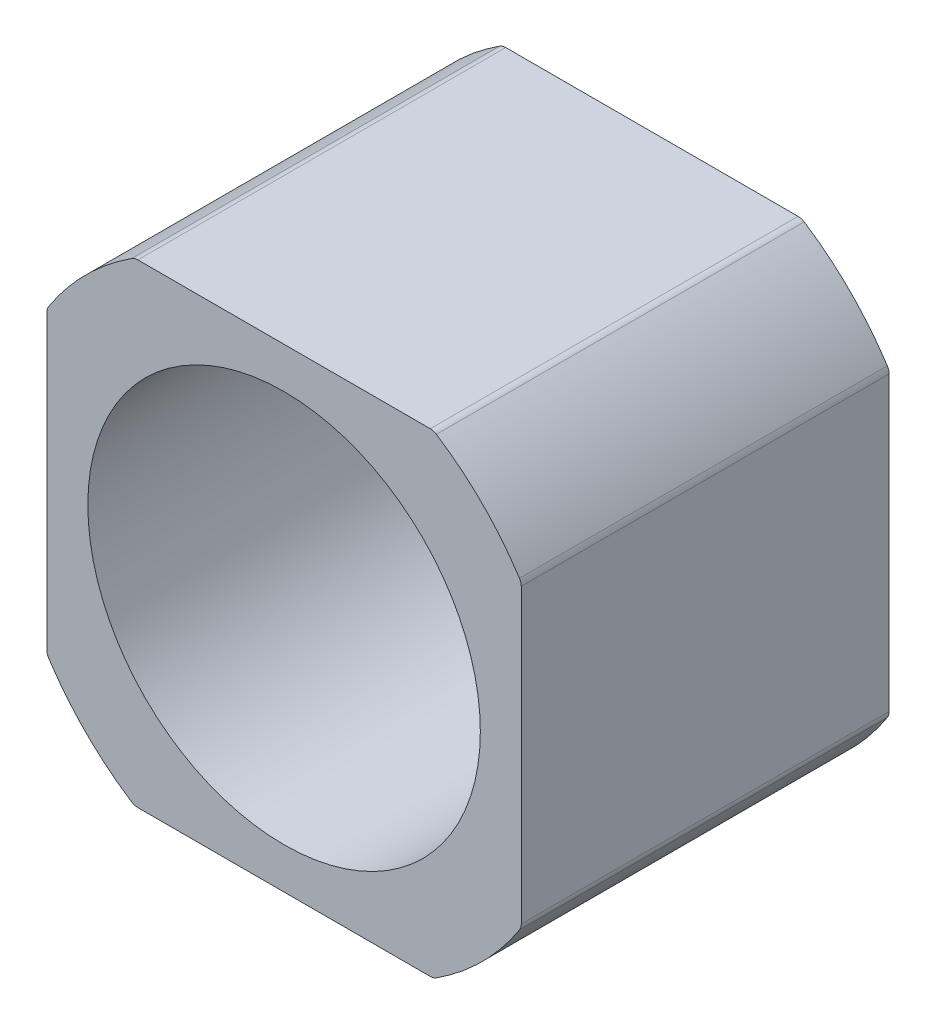
ISO-10303-21;
HEADER;
FILE_DESCRIPTION(('STEP AP214'),'2;1');
FILE_NAME('part.step','',(''),(''),'','','');
FILE_SCHEMA(('AUTOMOTIVE_DESIGN { 1 0 10303 214 1 1 1 1 }'));
ENDSEC;
DATA;
#1=APPLICATION_CONTEXT('core data for automotive mechanical design processes');
#2=APPLICATION_PROTOCOL_DEFINITION('international standard','automotive_design',2000,#1);
#3=PRODUCT_CONTEXT('',#1,'mechanical');
#4=PRODUCT('Part','Part','',(#3));
#5=PRODUCT_RELATED_PRODUCT_CATEGORY('part','',(#4));
#6=PRODUCT_DEFINITION_FORMATION('','',#4);
#7=PRODUCT_DEFINITION_CONTEXT('part definition',#1,'design');
#8=PRODUCT_DEFINITION('design','',#6,#7);
#9=PRODUCT_DEFINITION_SHAPE('','',#8);
#10=(LENGTH_UNIT() NAMED_UNIT(*) SI_UNIT(.MILLI.,.METRE.));
#11=(NAMED_UNIT(*) PLANE_ANGLE_UNIT() SI_UNIT($,.RADIAN.));
#12=(NAMED_UNIT(*) SI_UNIT($,.STERADIAN.) SOLID_ANGLE_UNIT());
#13=UNCERTAINTY_MEASURE_WITH_UNIT(LENGTH_MEASURE(1.E-05),#10,'distance_accuracy_value','');
#14=(GEOMETRIC_REPRESENTATION_CONTEXT(3) GLOBAL_UNCERTAINTY_ASSIGNED_CONTEXT((#13)) GLOBAL_UNIT_ASSIGNED_CONTEXT((#10,
#11,#12)) REPRESENTATION_CONTEXT('',''));
#15=CARTESIAN_POINT('',(0.,0.,0.));
#16=DIRECTION('',(0.,0.,1.));
#17=DIRECTION('',(1.,0.,0.));
#18=AXIS2_PLACEMENT_3D('',#15,#16,#17);
#19=CARTESIAN_POINT('',(21.15,21.15,32.8));
#20=DIRECTION('',(-1.,0.,0.));
#21=DIRECTION('',(0.,-1.,0.));
#22=AXIS2_PLACEMENT_3D('',#19,#20,#21);
#23=PLANE('',#22);
#24=DIRECTION('',(0.,1.,0.));
#25=VECTOR('',#24,1.);
#26=CARTESIAN_POINT('',(21.15,21.15,32.8));
#27=LINE('',#26,#25);
#28=CARTESIAN_POINT('',(21.15,-13.0375419462412,32.8));
#29=VERTEX_POINT('',#28);
#30=CARTESIAN_POINT('',(21.15,13.0375419462412,32.8));
#31=VERTEX_POINT('',#30);
#32=EDGE_CURVE('E207',#29,#31,#27,.T.);
#33=ORIENTED_EDGE('',*,*,#32,.F.);
#34=DIRECTION('',(0.,0.,-1.));
#35=VECTOR('',#34,1.);
#36=CARTESIAN_POINT('',(21.15,-13.0375419462412,0.));
#37=LINE('',#36,#35);
#38=CARTESIAN_POINT('',(21.15,-13.0375419462412,0.));
#39=VERTEX_POINT('',#38);
#40=EDGE_CURVE('E273',#29,#39,#37,.T.);
#41=ORIENTED_EDGE('',*,*,#40,.T.);
#42=DIRECTION('',(0.,1.,0.));
#43=VECTOR('',#42,1.);
#44=CARTESIAN_POINT('',(21.15,21.15,0.));
#45=LINE('',#44,#43);
#46=CARTESIAN_POINT('',(21.15,13.0375419462412,0.));
#47=VERTEX_POINT('',#46);
#48=EDGE_CURVE('E197',#39,#47,#45,.T.);
#49=ORIENTED_EDGE('',*,*,#48,.T.);
#50=DIRECTION('',(0.,0.,-1.));
#51=VECTOR('',#50,1.);
#52=CARTESIAN_POINT('',(21.15,13.0375419462412,32.8));
#53=LINE('',#52,#51);
#54=EDGE_CURVE('E271',#47,#31,#53,.F.);
#55=ORIENTED_EDGE('',*,*,#54,.T.);
#56=EDGE_LOOP('',(#33,#41,#49,#55));
#57=FACE_BOUND('',#56,.T.);
#58=ADVANCED_FACE('F34',(#57),#23,.F.);
#59=CARTESIAN_POINT('',(-21.15,21.15,32.8));
#60=DIRECTION('',(0.,-1.,0.));
#61=DIRECTION('',(1.,0.,0.));
#62=AXIS2_PLACEMENT_3D('',#59,#60,#61);
#63=PLANE('',#62);
#64=DIRECTION('',(-1.,0.,0.));
#65=VECTOR('',#64,1.);
#66=CARTESIAN_POINT('',(-21.15,21.15,0.));
#67=LINE('',#66,#65);
#68=CARTESIAN_POINT('',(13.0375419462413,21.15,0.));
#69=VERTEX_POINT('',#68);
#70=CARTESIAN_POINT('',(-13.0375419462413,21.15,0.));
#71=VERTEX_POINT('',#70);
#72=EDGE_CURVE('E200',#69,#71,#67,.T.);
#73=ORIENTED_EDGE('',*,*,#72,.T.);
#74=DIRECTION('',(0.,0.,-1.));
#75=VECTOR('',#74,1.);
#76=CARTESIAN_POINT('',(-13.0375419462413,21.15,32.8));
#77=LINE('',#76,#75);
#78=CARTESIAN_POINT('',(-13.0375419462413,21.15,32.8));
#79=VERTEX_POINT('',#78);
#80=EDGE_CURVE('E155',#71,#79,#77,.F.);
#81=ORIENTED_EDGE('',*,*,#80,.T.);
#82=DIRECTION('',(-1.,0.,0.));
#83=VECTOR('',#82,1.);
#84=CARTESIAN_POINT('',(-21.15,21.15,32.8));
#85=LINE('',#84,#83);
#86=CARTESIAN_POINT('',(13.0375419462413,21.15,32.8));
#87=VERTEX_POINT('',#86);
#88=EDGE_CURVE('E193',#87,#79,#85,.T.);
#89=ORIENTED_EDGE('',*,*,#88,.F.);
#90=DIRECTION('',(0.,0.,-1.));
#91=VECTOR('',#90,1.);
#92=CARTESIAN_POINT('',(13.0375419462413,21.15,0.));
#93=LINE('',#92,#91);
#94=EDGE_CURVE('E160',#87,#69,#93,.T.);
#95=ORIENTED_EDGE('',*,*,#94,.T.);
#96=EDGE_LOOP('',(#73,#81,#89,#95));
#97=FACE_BOUND('',#96,.T.);
#98=ADVANCED_FACE('F320',(#97),#63,.F.);
#99=CARTESIAN_POINT('',(-21.15,21.15,32.8));
#100=DIRECTION('',(1.,0.,0.));
#101=DIRECTION('',(0.,0.,-1.));
#102=AXIS2_PLACEMENT_3D('',#99,#100,#101);
#103=PLANE('',#102);
#104=DIRECTION('',(0.,-1.,0.));
#105=VECTOR('',#104,1.);
#106=CARTESIAN_POINT('',(-21.15,21.15,32.8));
#107=LINE('',#106,#105);
#108=CARTESIAN_POINT('',(-21.15,13.0375419462413,32.8));
#109=VERTEX_POINT('',#108);
#110=CARTESIAN_POINT('',(-21.15,-13.0375419462413,32.8));
#111=VERTEX_POINT('',#110);
#112=EDGE_CURVE('E189',#109,#111,#107,.T.);
#113=ORIENTED_EDGE('',*,*,#112,.F.);
#114=DIRECTION('',(0.,0.,-1.));
#115=VECTOR('',#114,1.);
#116=CARTESIAN_POINT('',(-21.15,13.0375419462413,0.));
#117=LINE('',#116,#115);
#118=CARTESIAN_POINT('',(-21.15,13.0375419462413,0.));
#119=VERTEX_POINT('',#118);
#120=EDGE_CURVE('E250',#109,#119,#117,.T.);
#121=ORIENTED_EDGE('',*,*,#120,.T.);
#122=DIRECTION('',(0.,-1.,0.));
#123=VECTOR('',#122,1.);
#124=CARTESIAN_POINT('',(-21.15,21.15,0.));
#125=LINE('',#124,#123);
#126=CARTESIAN_POINT('',(-21.15,-13.0375419462413,0.));
#127=VERTEX_POINT('',#126);
#128=EDGE_CURVE('E203',#119,#127,#125,.T.);
#129=ORIENTED_EDGE('',*,*,#128,.T.);
#130=DIRECTION('',(0.,0.,-1.));
#131=VECTOR('',#130,1.);
#132=CARTESIAN_POINT('',(-21.15,-13.0375419462413,32.8));
#133=LINE('',#132,#131);
#134=EDGE_CURVE('E247',#127,#111,#133,.F.);
#135=ORIENTED_EDGE('',*,*,#134,.T.);
#136=EDGE_LOOP('',(#113,#121,#129,#135));
#137=FACE_BOUND('',#136,.T.);
#138=ADVANCED_FACE('F322',(#137),#103,.F.);
#139=CARTESIAN_POINT('',(-21.15,-21.15,32.8));
#140=DIRECTION('',(0.,1.,0.));
#141=DIRECTION('',(0.,0.,1.));
#142=AXIS2_PLACEMENT_3D('',#139,#140,#141);
#143=PLANE('',#142);
#144=DIRECTION('',(1.,0.,0.));
#145=VECTOR('',#144,1.);
#146=CARTESIAN_POINT('',(-21.15,-21.15,32.8));
#147=LINE('',#146,#145);
#148=CARTESIAN_POINT('',(-13.0375419462412,-21.15,32.8));
#149=VERTEX_POINT('',#148);
#150=CARTESIAN_POINT('',(13.0375419462412,-21.15,32.8));
#151=VERTEX_POINT('',#150);
#152=EDGE_CURVE('E185',#149,#151,#147,.T.);
#153=ORIENTED_EDGE('',*,*,#152,.F.);
#154=DIRECTION('',(0.,0.,-1.));
#155=VECTOR('',#154,1.);
#156=CARTESIAN_POINT('',(-13.0375419462412,-21.15,0.));
#157=LINE('',#156,#155);
#158=CARTESIAN_POINT('',(-13.0375419462412,-21.15,0.));
#159=VERTEX_POINT('',#158);
#160=EDGE_CURVE('E265',#149,#159,#157,.T.);
#161=ORIENTED_EDGE('',*,*,#160,.T.);
#162=DIRECTION('',(1.,0.,0.));
#163=VECTOR('',#162,1.);
#164=CARTESIAN_POINT('',(-21.15,-21.15,0.));
#165=LINE('',#164,#163);
#166=CARTESIAN_POINT('',(13.0375419462412,-21.15,0.));
#167=VERTEX_POINT('',#166);
#168=EDGE_CURVE('E205',#159,#167,#165,.T.);
#169=ORIENTED_EDGE('',*,*,#168,.T.);
#170=DIRECTION('',(0.,0.,-1.));
#171=VECTOR('',#170,1.);
#172=CARTESIAN_POINT('',(13.0375419462412,-21.15,32.8));
#173=LINE('',#172,#171);
#174=EDGE_CURVE('E263',#167,#151,#173,.F.);
#175=ORIENTED_EDGE('',*,*,#174,.T.);
#176=EDGE_LOOP('',(#153,#161,#169,#175));
#177=FACE_BOUND('',#176,.T.);
#178=ADVANCED_FACE('F239',(#177),#143,.F.);
#179=CARTESIAN_POINT('',(0.,0.,32.8));
#180=DIRECTION('',(0.,0.,1.));
#181=DIRECTION('',(1.,0.,0.));
#182=AXIS2_PLACEMENT_3D('',#179,#180,#181);
#183=PLANE('',#182);
#184=CARTESIAN_POINT('',(0.,0.,32.8));
#185=DIRECTION('',(0.,0.,1.));
#186=DIRECTION('',(1.,0.,0.));
#187=AXIS2_PLACEMENT_3D('',#184,#185,#186);
#188=CIRCLE('',#187,17.5);
#189=CARTESIAN_POINT('',(17.5,0.,32.8));
#190=VERTEX_POINT('',#189);
#191=EDGE_CURVE('E224',#190,#190,#188,.T.);
#192=ORIENTED_EDGE('',*,*,#191,.F.);
#193=EDGE_LOOP('',(#192));
#194=FACE_BOUND('',#193,.T.);
#195=ORIENTED_EDGE('',*,*,#88,.T.);
#196=CARTESIAN_POINT('',(-13.0375419462413,20.15,32.8));
#197=DIRECTION('',(0.,0.,1.));
#198=DIRECTION('',(1.,0.,0.));
#199=AXIS2_PLACEMENT_3D('',#196,#197,#198);
#200=CIRCLE('',#199,1.);
#201=CARTESIAN_POINT('',(-13.580772860668,20.9895833333333,32.8));
#202=VERTEX_POINT('',#201);
#203=EDGE_CURVE('E242',#79,#202,#200,.T.);
#204=ORIENTED_EDGE('',*,*,#203,.T.);
#205=CARTESIAN_POINT('',(0.,0.,32.8));
#206=DIRECTION('',(0.,0.,1.));
#207=DIRECTION('',(1.,0.,0.));
#208=AXIS2_PLACEMENT_3D('',#205,#206,#207);
#209=CIRCLE('',#208,25.);
#210=CARTESIAN_POINT('',(-20.9895833333333,13.580772860668,32.8));
#211=VERTEX_POINT('',#210);
#212=EDGE_CURVE('E171',#202,#211,#209,.T.);
#213=ORIENTED_EDGE('',*,*,#212,.T.);
#214=CARTESIAN_POINT('',(-20.15,13.0375419462413,32.8));
#215=DIRECTION('',(0.,0.,1.));
#216=DIRECTION('',(1.,0.,0.));
#217=AXIS2_PLACEMENT_3D('',#214,#215,#216);
#218=CIRCLE('',#217,1.);
#219=EDGE_CURVE('E248',#211,#109,#218,.T.);
#220=ORIENTED_EDGE('',*,*,#219,.T.);
#221=ORIENTED_EDGE('',*,*,#112,.T.);
#222=CARTESIAN_POINT('',(-20.15,-13.0375419462413,32.8));
#223=DIRECTION('',(0.,0.,1.));
#224=DIRECTION('',(1.,0.,0.));
#225=AXIS2_PLACEMENT_3D('',#222,#223,#224);
#226=CIRCLE('',#225,1.);
#227=CARTESIAN_POINT('',(-20.9895833333333,-13.580772860668,32.8));
#228=VERTEX_POINT('',#227);
#229=EDGE_CURVE('E252',#111,#228,#226,.T.);
#230=ORIENTED_EDGE('',*,*,#229,.T.);
#231=CARTESIAN_POINT('',(-13.580772860668,-20.9895833333333,32.8));
#232=VERTEX_POINT('',#231);
#233=EDGE_CURVE('E219',#228,#232,#209,.T.);
#234=ORIENTED_EDGE('',*,*,#233,.T.);
#235=CARTESIAN_POINT('',(-13.0375419462412,-20.15,32.8));
#236=DIRECTION('',(0.,0.,1.));
#237=DIRECTION('',(1.,0.,0.));
#238=AXIS2_PLACEMENT_3D('',#235,#236,#237);
#239=CIRCLE('',#238,1.);
#240=EDGE_CURVE('E286',#232,#149,#239,.T.);
#241=ORIENTED_EDGE('',*,*,#240,.T.);
#242=ORIENTED_EDGE('',*,*,#152,.T.);
#243=CARTESIAN_POINT('',(13.0375419462412,-20.15,32.8));
#244=DIRECTION('',(0.,0.,1.));
#245=DIRECTION('',(1.,0.,0.));
#246=AXIS2_PLACEMENT_3D('',#243,#244,#245);
#247=CIRCLE('',#246,1.);
#248=CARTESIAN_POINT('',(13.580772860668,-20.9895833333333,32.8));
#249=VERTEX_POINT('',#248);
#250=EDGE_CURVE('E57',#151,#249,#247,.T.);
#251=ORIENTED_EDGE('',*,*,#250,.T.);
#252=CARTESIAN_POINT('',(20.9895833333333,-13.580772860668,32.8));
#253=VERTEX_POINT('',#252);
#254=EDGE_CURVE('E217',#249,#253,#209,.T.);
#255=ORIENTED_EDGE('',*,*,#254,.T.);
#256=CARTESIAN_POINT('',(20.15,-13.0375419462412,32.8));
#257=DIRECTION('',(0.,0.,1.));
#258=DIRECTION('',(1.,0.,0.));
#259=AXIS2_PLACEMENT_3D('',#256,#257,#258);
#260=CIRCLE('',#259,1.);
#261=EDGE_CURVE('E49',#253,#29,#260,.T.);
#262=ORIENTED_EDGE('',*,*,#261,.T.);
#263=ORIENTED_EDGE('',*,*,#32,.T.);
#264=CARTESIAN_POINT('',(20.15,13.0375419462412,32.8));
#265=DIRECTION('',(0.,0.,1.));
#266=DIRECTION('',(1.,0.,0.));
#267=AXIS2_PLACEMENT_3D('',#264,#265,#266);
#268=CIRCLE('',#267,1.);
#269=CARTESIAN_POINT('',(20.9895833333333,13.580772860668,32.8));
#270=VERTEX_POINT('',#269);
#271=EDGE_CURVE('E283',#31,#270,#268,.T.);
#272=ORIENTED_EDGE('',*,*,#271,.T.);
#273=CARTESIAN_POINT('',(13.580772860668,20.9895833333333,32.8));
#274=VERTEX_POINT('',#273);
#275=EDGE_CURVE('E223',#270,#274,#209,.T.);
#276=ORIENTED_EDGE('',*,*,#275,.T.);
#277=CARTESIAN_POINT('',(13.0375419462413,20.15,32.8));
#278=DIRECTION('',(0.,0.,1.));
#279=DIRECTION('',(1.,0.,0.));
#280=AXIS2_PLACEMENT_3D('',#277,#278,#279);
#281=CIRCLE('',#280,1.);
#282=EDGE_CURVE('E244',#274,#87,#281,.T.);
#283=ORIENTED_EDGE('',*,*,#282,.T.);
#284=EDGE_LOOP('',(#195,#204,#213,#220,#221,#230,#234,#241,#242,#251,#255,#262,#263,#272,#276,#283));
#285=FACE_BOUND('',#284,.T.);
#286=ADVANCED_FACE('F237',(#194,#285),#183,.T.);
#287=CARTESIAN_POINT('',(0.,0.,0.));
#288=DIRECTION('',(0.,0.,1.));
#289=DIRECTION('',(1.,0.,0.));
#290=AXIS2_PLACEMENT_3D('',#287,#288,#289);
#291=PLANE('',#290);
#292=CARTESIAN_POINT('',(0.,0.,0.));
#293=DIRECTION('',(0.,0.,1.));
#294=DIRECTION('',(1.,0.,0.));
#295=AXIS2_PLACEMENT_3D('',#292,#293,#294);
#296=CIRCLE('',#295,17.5);
#297=CARTESIAN_POINT('',(17.5,0.,0.));
#298=VERTEX_POINT('',#297);
#299=EDGE_CURVE('E220',#298,#298,#296,.T.);
#300=ORIENTED_EDGE('',*,*,#299,.T.);
#301=EDGE_LOOP('',(#300));
#302=FACE_BOUND('',#301,.T.);
#303=CARTESIAN_POINT('',(0.,0.,0.));
#304=DIRECTION('',(0.,0.,1.));
#305=DIRECTION('',(1.,0.,0.));
#306=AXIS2_PLACEMENT_3D('',#303,#304,#305);
#307=CIRCLE('',#306,25.);
#308=CARTESIAN_POINT('',(-13.580772860668,20.9895833333333,0.));
#309=VERTEX_POINT('',#308);
#310=CARTESIAN_POINT('',(-20.9895833333333,13.580772860668,0.));
#311=VERTEX_POINT('',#310);
#312=EDGE_CURVE('E168',#309,#311,#307,.T.);
#313=ORIENTED_EDGE('',*,*,#312,.F.);
#314=CARTESIAN_POINT('',(-13.0375419462413,20.15,0.));
#315=DIRECTION('',(0.,0.,1.));
#316=DIRECTION('',(1.,0.,0.));
#317=AXIS2_PLACEMENT_3D('',#314,#315,#316);
#318=CIRCLE('',#317,1.);
#319=EDGE_CURVE('E150',#309,#71,#318,.F.);
#320=ORIENTED_EDGE('',*,*,#319,.T.);
#321=ORIENTED_EDGE('',*,*,#72,.F.);
#322=CARTESIAN_POINT('',(13.0375419462413,20.15,0.));
#323=DIRECTION('',(0.,0.,1.));
#324=DIRECTION('',(1.,0.,0.));
#325=AXIS2_PLACEMENT_3D('',#322,#323,#324);
#326=CIRCLE('',#325,1.);
#327=CARTESIAN_POINT('',(13.580772860668,20.9895833333333,0.));
#328=VERTEX_POINT('',#327);
#329=EDGE_CURVE('E172',#69,#328,#326,.F.);
#330=ORIENTED_EDGE('',*,*,#329,.T.);
#331=CARTESIAN_POINT('',(0.,0.,0.));
#332=DIRECTION('',(0.,0.,1.));
#333=DIRECTION('',(1.,0.,0.));
#334=AXIS2_PLACEMENT_3D('',#331,#332,#333);
#335=CIRCLE('',#334,25.);
#336=CARTESIAN_POINT('',(20.9895833333333,13.580772860668,0.));
#337=VERTEX_POINT('',#336);
#338=EDGE_CURVE('E201',#337,#328,#335,.T.);
#339=ORIENTED_EDGE('',*,*,#338,.F.);
#340=CARTESIAN_POINT('',(20.15,13.0375419462412,0.));
#341=DIRECTION('',(0.,0.,1.));
#342=DIRECTION('',(1.,0.,0.));
#343=AXIS2_PLACEMENT_3D('',#340,#341,#342);
#344=CIRCLE('',#343,1.);
#345=EDGE_CURVE('E316',#337,#47,#344,.F.);
#346=ORIENTED_EDGE('',*,*,#345,.T.);
#347=ORIENTED_EDGE('',*,*,#48,.F.);
#348=CARTESIAN_POINT('',(20.15,-13.0375419462412,0.));
#349=DIRECTION('',(0.,0.,1.));
#350=DIRECTION('',(1.,0.,0.));
#351=AXIS2_PLACEMENT_3D('',#348,#349,#350);
#352=CIRCLE('',#351,1.);
#353=CARTESIAN_POINT('',(20.9895833333333,-13.580772860668,0.));
#354=VERTEX_POINT('',#353);
#355=EDGE_CURVE('E315',#39,#354,#352,.F.);
#356=ORIENTED_EDGE('',*,*,#355,.T.);
#357=CARTESIAN_POINT('',(13.580772860668,-20.9895833333333,0.));
#358=VERTEX_POINT('',#357);
#359=EDGE_CURVE('E180',#358,#354,#307,.T.);
#360=ORIENTED_EDGE('',*,*,#359,.F.);
#361=CARTESIAN_POINT('',(13.0375419462412,-20.15,0.));
#362=DIRECTION('',(0.,0.,1.));
#363=DIRECTION('',(1.,0.,0.));
#364=AXIS2_PLACEMENT_3D('',#361,#362,#363);
#365=CIRCLE('',#364,1.);
#366=EDGE_CURVE('E300',#358,#167,#365,.F.);
#367=ORIENTED_EDGE('',*,*,#366,.T.);
#368=ORIENTED_EDGE('',*,*,#168,.F.);
#369=CARTESIAN_POINT('',(-13.0375419462412,-20.15,0.));
#370=DIRECTION('',(0.,0.,1.));
#371=DIRECTION('',(1.,0.,0.));
#372=AXIS2_PLACEMENT_3D('',#369,#370,#371);
#373=CIRCLE('',#372,1.);
#374=CARTESIAN_POINT('',(-13.580772860668,-20.9895833333333,0.));
#375=VERTEX_POINT('',#374);
#376=EDGE_CURVE('E297',#159,#375,#373,.F.);
#377=ORIENTED_EDGE('',*,*,#376,.T.);
#378=CARTESIAN_POINT('',(-20.9895833333333,-13.580772860668,0.));
#379=VERTEX_POINT('',#378);
#380=EDGE_CURVE('E178',#379,#375,#307,.T.);
#381=ORIENTED_EDGE('',*,*,#380,.F.);
#382=CARTESIAN_POINT('',(-20.15,-13.0375419462413,0.));
#383=DIRECTION('',(0.,0.,1.));
#384=DIRECTION('',(1.,0.,0.));
#385=AXIS2_PLACEMENT_3D('',#382,#383,#384);
#386=CIRCLE('',#385,1.);
#387=EDGE_CURVE('E296',#379,#127,#386,.F.);
#388=ORIENTED_EDGE('',*,*,#387,.T.);
#389=ORIENTED_EDGE('',*,*,#128,.F.);
#390=CARTESIAN_POINT('',(-20.15,13.0375419462413,0.));
#391=DIRECTION('',(0.,0.,1.));
#392=DIRECTION('',(1.,0.,0.));
#393=AXIS2_PLACEMENT_3D('',#390,#391,#392);
#394=CIRCLE('',#393,1.);
#395=EDGE_CURVE('E161',#119,#311,#394,.F.);
#396=ORIENTED_EDGE('',*,*,#395,.T.);
#397=EDGE_LOOP('',(#313,#320,#321,#330,#339,#346,#347,#356,#360,#367,#368,#377,#381,#388,#389,#396));
#398=FACE_BOUND('',#397,.T.);
#399=ADVANCED_FACE('F175',(#302,#398),#291,.F.);
#400=CARTESIAN_POINT('',(0.,0.,0.));
#401=DIRECTION('',(0.,0.,1.));
#402=DIRECTION('',(1.,0.,0.));
#403=AXIS2_PLACEMENT_3D('',#400,#401,#402);
#404=CYLINDRICAL_SURFACE('',#403,25.);
#405=ORIENTED_EDGE('',*,*,#254,.F.);
#406=DIRECTION('',(0.,0.,1.));
#407=VECTOR('',#406,1.);
#408=CARTESIAN_POINT('',(13.580772860668,-20.9895833333333,0.));
#409=LINE('',#408,#407);
#410=EDGE_CURVE('E269',#249,#358,#409,.F.);
#411=ORIENTED_EDGE('',*,*,#410,.T.);
#412=ORIENTED_EDGE('',*,*,#359,.T.);
#413=DIRECTION('',(0.,0.,1.));
#414=VECTOR('',#413,1.);
#415=CARTESIAN_POINT('',(20.9895833333333,-13.580772860668,0.));
#416=LINE('',#415,#414);
#417=EDGE_CURVE('E267',#354,#253,#416,.T.);
#418=ORIENTED_EDGE('',*,*,#417,.T.);
#419=EDGE_LOOP('',(#405,#411,#412,#418));
#420=FACE_BOUND('',#419,.T.);
#421=ADVANCED_FACE('F371',(#420),#404,.T.);
#422=ORIENTED_EDGE('',*,*,#233,.F.);
#423=DIRECTION('',(0.,0.,1.));
#424=VECTOR('',#423,1.);
#425=CARTESIAN_POINT('',(-20.9895833333333,-13.580772860668,0.));
#426=LINE('',#425,#424);
#427=EDGE_CURVE('E260',#228,#379,#426,.F.);
#428=ORIENTED_EDGE('',*,*,#427,.T.);
#429=ORIENTED_EDGE('',*,*,#380,.T.);
#430=DIRECTION('',(0.,0.,1.));
#431=VECTOR('',#430,1.);
#432=CARTESIAN_POINT('',(-13.580772860668,-20.9895833333333,0.));
#433=LINE('',#432,#431);
#434=EDGE_CURVE('E257',#375,#232,#433,.T.);
#435=ORIENTED_EDGE('',*,*,#434,.T.);
#436=EDGE_LOOP('',(#422,#428,#429,#435));
#437=FACE_BOUND('',#436,.T.);
#438=ADVANCED_FACE('F290',(#437),#404,.T.);
#439=ORIENTED_EDGE('',*,*,#212,.F.);
#440=DIRECTION('',(0.,0.,1.));
#441=VECTOR('',#440,1.);
#442=CARTESIAN_POINT('',(-13.580772860668,20.9895833333333,0.));
#443=LINE('',#442,#441);
#444=EDGE_CURVE('E154',#202,#309,#443,.F.);
#445=ORIENTED_EDGE('',*,*,#444,.T.);
#446=ORIENTED_EDGE('',*,*,#312,.T.);
#447=DIRECTION('',(0.,0.,1.));
#448=VECTOR('',#447,1.);
#449=CARTESIAN_POINT('',(-20.9895833333333,13.580772860668,0.));
#450=LINE('',#449,#448);
#451=EDGE_CURVE('E173',#311,#211,#450,.T.);
#452=ORIENTED_EDGE('',*,*,#451,.T.);
#453=EDGE_LOOP('',(#439,#445,#446,#452));
#454=FACE_BOUND('',#453,.T.);
#455=ADVANCED_FACE('F166',(#454),#404,.T.);
#456=ORIENTED_EDGE('',*,*,#275,.F.);
#457=DIRECTION('',(0.,0.,1.));
#458=VECTOR('',#457,1.);
#459=CARTESIAN_POINT('',(20.9895833333333,13.580772860668,0.));
#460=LINE('',#459,#458);
#461=EDGE_CURVE('E11',#270,#337,#460,.F.);
#462=ORIENTED_EDGE('',*,*,#461,.T.);
#463=ORIENTED_EDGE('',*,*,#338,.T.);
#464=DIRECTION('',(0.,0.,1.));
#465=VECTOR('',#464,1.);
#466=CARTESIAN_POINT('',(13.580772860668,20.9895833333333,0.));
#467=LINE('',#466,#465);
#468=EDGE_CURVE('E42',#328,#274,#467,.T.);
#469=ORIENTED_EDGE('',*,*,#468,.T.);
#470=EDGE_LOOP('',(#456,#462,#463,#469));
#471=FACE_BOUND('',#470,.T.);
#472=ADVANCED_FACE('F278',(#471),#404,.T.);
#473=CARTESIAN_POINT('',(-13.0375419462413,20.15,0.));
#474=DIRECTION('',(0.,0.,1.));
#475=DIRECTION('',(1.,0.,0.));
#476=AXIS2_PLACEMENT_3D('',#473,#474,#475);
#477=CYLINDRICAL_SURFACE('',#476,1.);
#478=ORIENTED_EDGE('',*,*,#203,.F.);
#479=ORIENTED_EDGE('',*,*,#80,.F.);
#480=ORIENTED_EDGE('',*,*,#319,.F.);
#481=ORIENTED_EDGE('',*,*,#444,.F.);
#482=EDGE_LOOP('',(#478,#479,#480,#481));
#483=FACE_BOUND('',#482,.T.);
#484=ADVANCED_FACE('F153',(#483),#477,.T.);
#485=CARTESIAN_POINT('',(-20.15,13.0375419462413,0.));
#486=DIRECTION('',(0.,0.,1.));
#487=DIRECTION('',(1.,0.,0.));
#488=AXIS2_PLACEMENT_3D('',#485,#486,#487);
#489=CYLINDRICAL_SURFACE('',#488,1.);
#490=ORIENTED_EDGE('',*,*,#395,.F.);
#491=ORIENTED_EDGE('',*,*,#120,.F.);
#492=ORIENTED_EDGE('',*,*,#219,.F.);
#493=ORIENTED_EDGE('',*,*,#451,.F.);
#494=EDGE_LOOP('',(#490,#491,#492,#493));
#495=FACE_BOUND('',#494,.T.);
#496=ADVANCED_FACE('F335',(#495),#489,.T.);
#497=CARTESIAN_POINT('',(-20.15,-13.0375419462413,0.));
#498=DIRECTION('',(0.,0.,1.));
#499=DIRECTION('',(1.,0.,0.));
#500=AXIS2_PLACEMENT_3D('',#497,#498,#499);
#501=CYLINDRICAL_SURFACE('',#500,1.);
#502=ORIENTED_EDGE('',*,*,#229,.F.);
#503=ORIENTED_EDGE('',*,*,#134,.F.);
#504=ORIENTED_EDGE('',*,*,#387,.F.);
#505=ORIENTED_EDGE('',*,*,#427,.F.);
#506=EDGE_LOOP('',(#502,#503,#504,#505));
#507=FACE_BOUND('',#506,.T.);
#508=ADVANCED_FACE('F294',(#507),#501,.T.);
#509=CARTESIAN_POINT('',(-13.0375419462412,-20.15,0.));
#510=DIRECTION('',(0.,0.,1.));
#511=DIRECTION('',(1.,0.,0.));
#512=AXIS2_PLACEMENT_3D('',#509,#510,#511);
#513=CYLINDRICAL_SURFACE('',#512,1.);
#514=ORIENTED_EDGE('',*,*,#376,.F.);
#515=ORIENTED_EDGE('',*,*,#160,.F.);
#516=ORIENTED_EDGE('',*,*,#240,.F.);
#517=ORIENTED_EDGE('',*,*,#434,.F.);
#518=EDGE_LOOP('',(#514,#515,#516,#517));
#519=FACE_BOUND('',#518,.T.);
#520=ADVANCED_FACE('F341',(#519),#513,.T.);
#521=CARTESIAN_POINT('',(13.0375419462412,-20.15,0.));
#522=DIRECTION('',(0.,0.,1.));
#523=DIRECTION('',(1.,0.,0.));
#524=AXIS2_PLACEMENT_3D('',#521,#522,#523);
#525=CYLINDRICAL_SURFACE('',#524,1.);
#526=ORIENTED_EDGE('',*,*,#250,.F.);
#527=ORIENTED_EDGE('',*,*,#174,.F.);
#528=ORIENTED_EDGE('',*,*,#366,.F.);
#529=ORIENTED_EDGE('',*,*,#410,.F.);
#530=EDGE_LOOP('',(#526,#527,#528,#529));
#531=FACE_BOUND('',#530,.T.);
#532=ADVANCED_FACE('F344',(#531),#525,.T.);
#533=CARTESIAN_POINT('',(20.15,-13.0375419462412,0.));
#534=DIRECTION('',(0.,0.,1.));
#535=DIRECTION('',(1.,0.,0.));
#536=AXIS2_PLACEMENT_3D('',#533,#534,#535);
#537=CYLINDRICAL_SURFACE('',#536,1.);
#538=ORIENTED_EDGE('',*,*,#355,.F.);
#539=ORIENTED_EDGE('',*,*,#40,.F.);
#540=ORIENTED_EDGE('',*,*,#261,.F.);
#541=ORIENTED_EDGE('',*,*,#417,.F.);
#542=EDGE_LOOP('',(#538,#539,#540,#541));
#543=FACE_BOUND('',#542,.T.);
#544=ADVANCED_FACE('F314',(#543),#537,.T.);
#545=CARTESIAN_POINT('',(20.15,13.0375419462412,0.));
#546=DIRECTION('',(0.,0.,1.));
#547=DIRECTION('',(1.,0.,0.));
#548=AXIS2_PLACEMENT_3D('',#545,#546,#547);
#549=CYLINDRICAL_SURFACE('',#548,1.);
#550=ORIENTED_EDGE('',*,*,#271,.F.);
#551=ORIENTED_EDGE('',*,*,#54,.F.);
#552=ORIENTED_EDGE('',*,*,#345,.F.);
#553=ORIENTED_EDGE('',*,*,#461,.F.);
#554=EDGE_LOOP('',(#550,#551,#552,#553));
#555=FACE_BOUND('',#554,.T.);
#556=ADVANCED_FACE('F350',(#555),#549,.T.);
#557=CARTESIAN_POINT('',(13.0375419462413,20.15,0.));
#558=DIRECTION('',(0.,0.,1.));
#559=DIRECTION('',(1.,0.,0.));
#560=AXIS2_PLACEMENT_3D('',#557,#558,#559);
#561=CYLINDRICAL_SURFACE('',#560,1.);
#562=ORIENTED_EDGE('',*,*,#329,.F.);
#563=ORIENTED_EDGE('',*,*,#94,.F.);
#564=ORIENTED_EDGE('',*,*,#282,.F.);
#565=ORIENTED_EDGE('',*,*,#468,.F.);
#566=EDGE_LOOP('',(#562,#563,#564,#565));
#567=FACE_BOUND('',#566,.T.);
#568=ADVANCED_FACE('F36',(#567),#561,.T.);
#569=CARTESIAN_POINT('',(0.,0.,0.));
#570=DIRECTION('',(0.,0.,1.));
#571=DIRECTION('',(1.,0.,0.));
#572=AXIS2_PLACEMENT_3D('',#569,#570,#571);
#573=CYLINDRICAL_SURFACE('',#572,17.5);
#574=ORIENTED_EDGE('',*,*,#299,.F.);
#575=EDGE_LOOP('',(#574));
#576=FACE_BOUND('',#575,.T.);
#577=ORIENTED_EDGE('',*,*,#191,.T.);
#578=EDGE_LOOP('',(#577));
#579=FACE_BOUND('',#578,.T.);
#580=ADVANCED_FACE('F231',(#576,#579),#573,.F.);
#581=CLOSED_SHELL('',(#58,#98,#138,#178,#286,#399,#421,#438,#455,#472,#484,#496,#508,#520,#532,
#544,#556,#568,#580));
#582=MANIFOLD_SOLID_BREP('B2',#581);
#583=ADVANCED_BREP_SHAPE_REPRESENTATION('',(#18,#582),#14);
#584=SHAPE_DEFINITION_REPRESENTATION(#9,#583);
ENDSEC;
END-ISO-10303-21;
